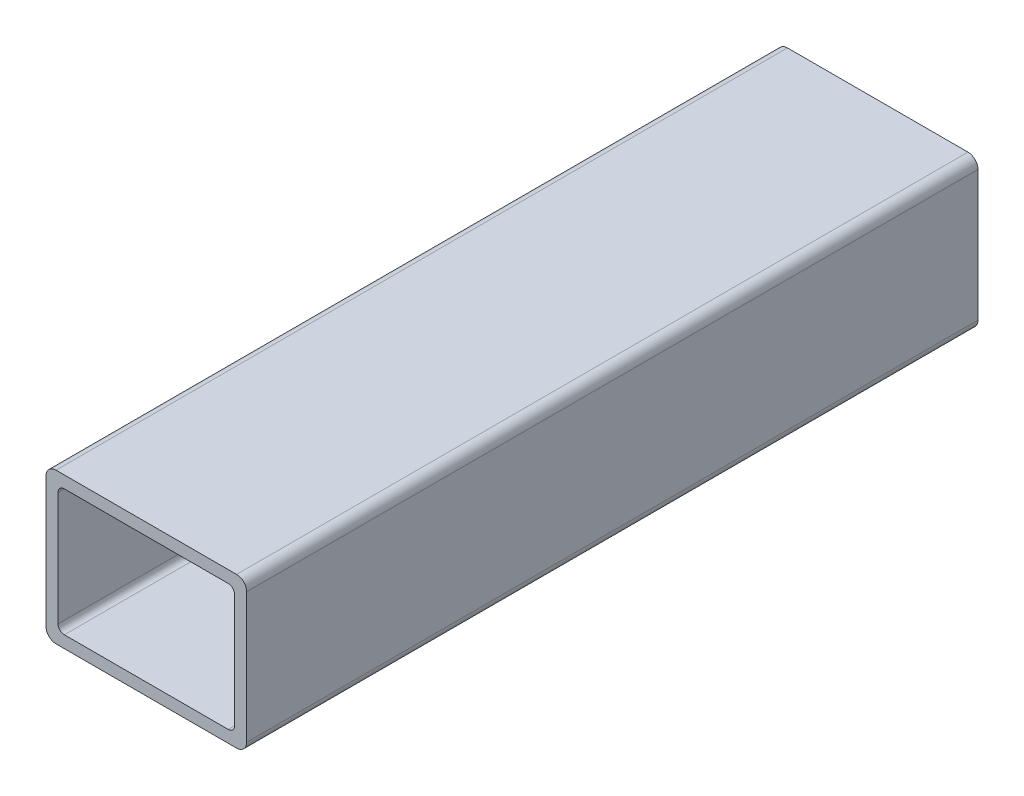
ISO-10303-21;
HEADER;
FILE_DESCRIPTION(('STEP AP214'),'2;1');
FILE_NAME('part.step','',(''),(''),'','','');
FILE_SCHEMA(('AUTOMOTIVE_DESIGN { 1 0 10303 214 1 1 1 1 }'));
ENDSEC;
DATA;
#1=APPLICATION_CONTEXT('core data for automotive mechanical design processes');
#2=APPLICATION_PROTOCOL_DEFINITION('international standard','automotive_design',2000,#1);
#3=PRODUCT_CONTEXT('',#1,'mechanical');
#4=PRODUCT('Part','Part','',(#3));
#5=PRODUCT_RELATED_PRODUCT_CATEGORY('part','',(#4));
#6=PRODUCT_DEFINITION_FORMATION('','',#4);
#7=PRODUCT_DEFINITION_CONTEXT('part definition',#1,'design');
#8=PRODUCT_DEFINITION('design','',#6,#7);
#9=PRODUCT_DEFINITION_SHAPE('','',#8);
#10=(LENGTH_UNIT() NAMED_UNIT(*) SI_UNIT(.MILLI.,.METRE.));
#11=(NAMED_UNIT(*) PLANE_ANGLE_UNIT() SI_UNIT($,.RADIAN.));
#12=(NAMED_UNIT(*) SI_UNIT($,.STERADIAN.) SOLID_ANGLE_UNIT());
#13=UNCERTAINTY_MEASURE_WITH_UNIT(LENGTH_MEASURE(1.E-05),#10,'distance_accuracy_value','');
#14=(GEOMETRIC_REPRESENTATION_CONTEXT(3) GLOBAL_UNCERTAINTY_ASSIGNED_CONTEXT((#13)) GLOBAL_UNIT_ASSIGNED_CONTEXT((#10,
#11,#12)) REPRESENTATION_CONTEXT('',''));
#15=CARTESIAN_POINT('',(0.,0.,0.));
#16=DIRECTION('',(0.,0.,1.));
#17=DIRECTION('',(1.,0.,0.));
#18=AXIS2_PLACEMENT_3D('',#15,#16,#17);
#19=CARTESIAN_POINT('',(22.86,-16.51,185.21934));
#20=DIRECTION('',(0.,0.,1.));
#21=DIRECTION('',(1.,0.,0.));
#22=AXIS2_PLACEMENT_3D('',#19,#20,#21);
#23=PLANE('',#22);
#24=CARTESIAN_POINT('',(22.86,-16.51,185.21934));
#25=DIRECTION('',(0.,0.,1.));
#26=DIRECTION('',(1.,0.,0.));
#27=AXIS2_PLACEMENT_3D('',#24,#25,#26);
#28=CIRCLE('',#27,2.53999999999999);
#29=CARTESIAN_POINT('',(22.86,-19.05,185.21934));
#30=VERTEX_POINT('',#29);
#31=CARTESIAN_POINT('',(25.4,-16.51,185.21934));
#32=VERTEX_POINT('',#31);
#33=EDGE_CURVE('E214',#30,#32,#28,.T.);
#34=ORIENTED_EDGE('',*,*,#33,.T.);
#35=DIRECTION('',(0.,1.,0.));
#36=VECTOR('',#35,1.);
#37=CARTESIAN_POINT('',(25.4,-16.51,185.21934));
#38=LINE('',#37,#36);
#39=CARTESIAN_POINT('',(25.4,16.51,185.21934));
#40=VERTEX_POINT('',#39);
#41=EDGE_CURVE('E217',#32,#40,#38,.T.);
#42=ORIENTED_EDGE('',*,*,#41,.T.);
#43=CARTESIAN_POINT('',(22.86,16.51,185.21934));
#44=DIRECTION('',(0.,0.,1.));
#45=DIRECTION('',(1.,0.,0.));
#46=AXIS2_PLACEMENT_3D('',#43,#44,#45);
#47=CIRCLE('',#46,2.54);
#48=CARTESIAN_POINT('',(22.86,19.05,185.21934));
#49=VERTEX_POINT('',#48);
#50=EDGE_CURVE('E220',#40,#49,#47,.T.);
#51=ORIENTED_EDGE('',*,*,#50,.T.);
#52=DIRECTION('',(-1.,0.,0.));
#53=VECTOR('',#52,1.);
#54=CARTESIAN_POINT('',(22.86,19.05,185.21934));
#55=LINE('',#54,#53);
#56=CARTESIAN_POINT('',(-22.86,19.05,185.21934));
#57=VERTEX_POINT('',#56);
#58=EDGE_CURVE('E222',#49,#57,#55,.T.);
#59=ORIENTED_EDGE('',*,*,#58,.T.);
#60=CARTESIAN_POINT('',(-22.86,16.51,185.21934));
#61=DIRECTION('',(0.,0.,1.));
#62=DIRECTION('',(1.,0.,0.));
#63=AXIS2_PLACEMENT_3D('',#60,#61,#62);
#64=CIRCLE('',#63,2.54);
#65=CARTESIAN_POINT('',(-25.4,16.51,185.21934));
#66=VERTEX_POINT('',#65);
#67=EDGE_CURVE('E224',#57,#66,#64,.T.);
#68=ORIENTED_EDGE('',*,*,#67,.T.);
#69=DIRECTION('',(0.,-1.,0.));
#70=VECTOR('',#69,1.);
#71=CARTESIAN_POINT('',(-25.4,-16.51,185.21934));
#72=LINE('',#71,#70);
#73=CARTESIAN_POINT('',(-25.4,-16.51,185.21934));
#74=VERTEX_POINT('',#73);
#75=EDGE_CURVE('E226',#66,#74,#72,.T.);
#76=ORIENTED_EDGE('',*,*,#75,.T.);
#77=CARTESIAN_POINT('',(-22.86,-16.51,185.21934));
#78=DIRECTION('',(0.,0.,1.));
#79=DIRECTION('',(1.,0.,0.));
#80=AXIS2_PLACEMENT_3D('',#77,#78,#79);
#81=CIRCLE('',#80,2.54);
#82=CARTESIAN_POINT('',(-22.86,-19.05,185.21934));
#83=VERTEX_POINT('',#82);
#84=EDGE_CURVE('E228',#74,#83,#81,.T.);
#85=ORIENTED_EDGE('',*,*,#84,.T.);
#86=DIRECTION('',(1.,0.,0.));
#87=VECTOR('',#86,1.);
#88=CARTESIAN_POINT('',(22.86,-19.05,185.21934));
#89=LINE('',#88,#87);
#90=EDGE_CURVE('E230',#83,#30,#89,.T.);
#91=ORIENTED_EDGE('',*,*,#90,.T.);
#92=EDGE_LOOP('',(#34,#42,#51,#59,#68,#76,#85,#91));
#93=FACE_BOUND('',#92,.T.);
#94=DIRECTION('',(-1.,0.,0.));
#95=VECTOR('',#94,1.);
#96=CARTESIAN_POINT('',(20.7518,16.002,185.21934));
#97=LINE('',#96,#95);
#98=CARTESIAN_POINT('',(20.7518,16.002,185.21934));
#99=VERTEX_POINT('',#98);
#100=CARTESIAN_POINT('',(-20.7518,16.002,185.21934));
#101=VERTEX_POINT('',#100);
#102=EDGE_CURVE('E157',#99,#101,#97,.T.);
#103=ORIENTED_EDGE('',*,*,#102,.F.);
#104=CARTESIAN_POINT('',(20.7518,14.4018,185.21934));
#105=DIRECTION('',(0.,0.,1.));
#106=DIRECTION('',(1.,0.,0.));
#107=AXIS2_PLACEMENT_3D('',#104,#105,#106);
#108=CIRCLE('',#107,1.6002);
#109=CARTESIAN_POINT('',(22.352,14.4018,185.21934));
#110=VERTEX_POINT('',#109);
#111=EDGE_CURVE('E149',#110,#99,#108,.T.);
#112=ORIENTED_EDGE('',*,*,#111,.F.);
#113=DIRECTION('',(0.,1.,0.));
#114=VECTOR('',#113,1.);
#115=CARTESIAN_POINT('',(22.352,14.4018,185.21934));
#116=LINE('',#115,#114);
#117=CARTESIAN_POINT('',(22.352,-14.4018,185.21934));
#118=VERTEX_POINT('',#117);
#119=EDGE_CURVE('E182',#118,#110,#116,.T.);
#120=ORIENTED_EDGE('',*,*,#119,.F.);
#121=CARTESIAN_POINT('',(20.7518,-14.4018,185.21934));
#122=DIRECTION('',(0.,0.,1.));
#123=DIRECTION('',(1.,0.,0.));
#124=AXIS2_PLACEMENT_3D('',#121,#122,#123);
#125=CIRCLE('',#124,1.6002);
#126=CARTESIAN_POINT('',(20.7518,-16.002,185.21934));
#127=VERTEX_POINT('',#126);
#128=EDGE_CURVE('E180',#127,#118,#125,.T.);
#129=ORIENTED_EDGE('',*,*,#128,.F.);
#130=DIRECTION('',(1.,0.,0.));
#131=VECTOR('',#130,1.);
#132=CARTESIAN_POINT('',(20.7518,-16.002,185.21934));
#133=LINE('',#132,#131);
#134=CARTESIAN_POINT('',(-20.7518,-16.002,185.21934));
#135=VERTEX_POINT('',#134);
#136=EDGE_CURVE('E178',#135,#127,#133,.T.);
#137=ORIENTED_EDGE('',*,*,#136,.F.);
#138=CARTESIAN_POINT('',(-20.7518,-14.4018,185.21934));
#139=DIRECTION('',(0.,0.,1.));
#140=DIRECTION('',(1.,0.,0.));
#141=AXIS2_PLACEMENT_3D('',#138,#139,#140);
#142=CIRCLE('',#141,1.6002);
#143=CARTESIAN_POINT('',(-22.352,-14.4018,185.21934));
#144=VERTEX_POINT('',#143);
#145=EDGE_CURVE('E176',#144,#135,#142,.T.);
#146=ORIENTED_EDGE('',*,*,#145,.F.);
#147=DIRECTION('',(0.,-1.,0.));
#148=VECTOR('',#147,1.);
#149=CARTESIAN_POINT('',(-22.352,14.4018,185.21934));
#150=LINE('',#149,#148);
#151=CARTESIAN_POINT('',(-22.352,14.4018,185.21934));
#152=VERTEX_POINT('',#151);
#153=EDGE_CURVE('E172',#152,#144,#150,.T.);
#154=ORIENTED_EDGE('',*,*,#153,.F.);
#155=CARTESIAN_POINT('',(-20.7518,14.4018,185.21934));
#156=DIRECTION('',(0.,0.,1.));
#157=DIRECTION('',(1.,0.,0.));
#158=AXIS2_PLACEMENT_3D('',#155,#156,#157);
#159=CIRCLE('',#158,1.6002);
#160=EDGE_CURVE('E170',#101,#152,#159,.T.);
#161=ORIENTED_EDGE('',*,*,#160,.F.);
#162=EDGE_LOOP('',(#103,#112,#120,#129,#137,#146,#154,#161));
#163=FACE_BOUND('',#162,.T.);
#164=ADVANCED_FACE('F36',(#93,#163),#23,.T.);
#165=CARTESIAN_POINT('',(22.86,-16.51,0.));
#166=DIRECTION('',(0.,0.,1.));
#167=DIRECTION('',(1.,0.,0.));
#168=AXIS2_PLACEMENT_3D('',#165,#166,#167);
#169=PLANE('',#168);
#170=CARTESIAN_POINT('',(22.86,-16.51,0.));
#171=DIRECTION('',(0.,0.,1.));
#172=DIRECTION('',(1.,0.,0.));
#173=AXIS2_PLACEMENT_3D('',#170,#171,#172);
#174=CIRCLE('',#173,2.53999999999999);
#175=CARTESIAN_POINT('',(22.86,-19.05,0.));
#176=VERTEX_POINT('',#175);
#177=CARTESIAN_POINT('',(25.4,-16.51,0.));
#178=VERTEX_POINT('',#177);
#179=EDGE_CURVE('E165',#176,#178,#174,.T.);
#180=ORIENTED_EDGE('',*,*,#179,.F.);
#181=DIRECTION('',(1.,0.,0.));
#182=VECTOR('',#181,1.);
#183=CARTESIAN_POINT('',(22.86,-19.05,0.));
#184=LINE('',#183,#182);
#185=CARTESIAN_POINT('',(-22.86,-19.05,0.));
#186=VERTEX_POINT('',#185);
#187=EDGE_CURVE('E218',#186,#176,#184,.T.);
#188=ORIENTED_EDGE('',*,*,#187,.F.);
#189=CARTESIAN_POINT('',(-22.86,-16.51,0.));
#190=DIRECTION('',(0.,0.,1.));
#191=DIRECTION('',(1.,0.,0.));
#192=AXIS2_PLACEMENT_3D('',#189,#190,#191);
#193=CIRCLE('',#192,2.54);
#194=CARTESIAN_POINT('',(-25.4,-16.51,0.));
#195=VERTEX_POINT('',#194);
#196=EDGE_CURVE('E245',#195,#186,#193,.T.);
#197=ORIENTED_EDGE('',*,*,#196,.F.);
#198=DIRECTION('',(0.,-1.,0.));
#199=VECTOR('',#198,1.);
#200=CARTESIAN_POINT('',(-25.4,-16.51,0.));
#201=LINE('',#200,#199);
#202=CARTESIAN_POINT('',(-25.4,16.51,0.));
#203=VERTEX_POINT('',#202);
#204=EDGE_CURVE('E243',#203,#195,#201,.T.);
#205=ORIENTED_EDGE('',*,*,#204,.F.);
#206=CARTESIAN_POINT('',(-22.86,16.51,0.));
#207=DIRECTION('',(0.,0.,1.));
#208=DIRECTION('',(1.,0.,0.));
#209=AXIS2_PLACEMENT_3D('',#206,#207,#208);
#210=CIRCLE('',#209,2.54);
#211=CARTESIAN_POINT('',(-22.86,19.05,0.));
#212=VERTEX_POINT('',#211);
#213=EDGE_CURVE('E241',#212,#203,#210,.T.);
#214=ORIENTED_EDGE('',*,*,#213,.F.);
#215=DIRECTION('',(-1.,0.,0.));
#216=VECTOR('',#215,1.);
#217=CARTESIAN_POINT('',(22.86,19.05,0.));
#218=LINE('',#217,#216);
#219=CARTESIAN_POINT('',(22.86,19.05,0.));
#220=VERTEX_POINT('',#219);
#221=EDGE_CURVE('E239',#220,#212,#218,.T.);
#222=ORIENTED_EDGE('',*,*,#221,.F.);
#223=CARTESIAN_POINT('',(22.86,16.51,0.));
#224=DIRECTION('',(0.,0.,1.));
#225=DIRECTION('',(1.,0.,0.));
#226=AXIS2_PLACEMENT_3D('',#223,#224,#225);
#227=CIRCLE('',#226,2.54);
#228=CARTESIAN_POINT('',(25.4,16.51,0.));
#229=VERTEX_POINT('',#228);
#230=EDGE_CURVE('E237',#229,#220,#227,.T.);
#231=ORIENTED_EDGE('',*,*,#230,.F.);
#232=DIRECTION('',(0.,1.,0.));
#233=VECTOR('',#232,1.);
#234=CARTESIAN_POINT('',(25.4,-16.51,0.));
#235=LINE('',#234,#233);
#236=EDGE_CURVE('E235',#178,#229,#235,.T.);
#237=ORIENTED_EDGE('',*,*,#236,.F.);
#238=EDGE_LOOP('',(#180,#188,#197,#205,#214,#222,#231,#237));
#239=FACE_BOUND('',#238,.T.);
#240=CARTESIAN_POINT('',(20.7518,14.4018,0.));
#241=DIRECTION('',(0.,0.,1.));
#242=DIRECTION('',(1.,0.,0.));
#243=AXIS2_PLACEMENT_3D('',#240,#241,#242);
#244=CIRCLE('',#243,1.6002);
#245=CARTESIAN_POINT('',(22.352,14.4018,0.));
#246=VERTEX_POINT('',#245);
#247=CARTESIAN_POINT('',(20.7518,16.002,0.));
#248=VERTEX_POINT('',#247);
#249=EDGE_CURVE('E59',#246,#248,#244,.T.);
#250=ORIENTED_EDGE('',*,*,#249,.T.);
#251=DIRECTION('',(-1.,0.,0.));
#252=VECTOR('',#251,1.);
#253=CARTESIAN_POINT('',(20.7518,16.002,0.));
#254=LINE('',#253,#252);
#255=CARTESIAN_POINT('',(-20.7518,16.002,0.));
#256=VERTEX_POINT('',#255);
#257=EDGE_CURVE('E164',#248,#256,#254,.T.);
#258=ORIENTED_EDGE('',*,*,#257,.T.);
#259=CARTESIAN_POINT('',(-20.7518,14.4018,0.));
#260=DIRECTION('',(0.,0.,1.));
#261=DIRECTION('',(1.,0.,0.));
#262=AXIS2_PLACEMENT_3D('',#259,#260,#261);
#263=CIRCLE('',#262,1.6002);
#264=CARTESIAN_POINT('',(-22.352,14.4018,0.));
#265=VERTEX_POINT('',#264);
#266=EDGE_CURVE('E186',#256,#265,#263,.T.);
#267=ORIENTED_EDGE('',*,*,#266,.T.);
#268=DIRECTION('',(0.,-1.,0.));
#269=VECTOR('',#268,1.);
#270=CARTESIAN_POINT('',(-22.352,14.4018,0.));
#271=LINE('',#270,#269);
#272=CARTESIAN_POINT('',(-22.352,-14.4018,0.));
#273=VERTEX_POINT('',#272);
#274=EDGE_CURVE('E189',#265,#273,#271,.T.);
#275=ORIENTED_EDGE('',*,*,#274,.T.);
#276=CARTESIAN_POINT('',(-20.7518,-14.4018,0.));
#277=DIRECTION('',(0.,0.,1.));
#278=DIRECTION('',(1.,0.,0.));
#279=AXIS2_PLACEMENT_3D('',#276,#277,#278);
#280=CIRCLE('',#279,1.6002);
#281=CARTESIAN_POINT('',(-20.7518,-16.002,0.));
#282=VERTEX_POINT('',#281);
#283=EDGE_CURVE('E192',#273,#282,#280,.T.);
#284=ORIENTED_EDGE('',*,*,#283,.T.);
#285=DIRECTION('',(1.,0.,0.));
#286=VECTOR('',#285,1.);
#287=CARTESIAN_POINT('',(20.7518,-16.002,0.));
#288=LINE('',#287,#286);
#289=CARTESIAN_POINT('',(20.7518,-16.002,0.));
#290=VERTEX_POINT('',#289);
#291=EDGE_CURVE('E195',#282,#290,#288,.T.);
#292=ORIENTED_EDGE('',*,*,#291,.T.);
#293=CARTESIAN_POINT('',(20.7518,-14.4018,0.));
#294=DIRECTION('',(0.,0.,1.));
#295=DIRECTION('',(1.,0.,0.));
#296=AXIS2_PLACEMENT_3D('',#293,#294,#295);
#297=CIRCLE('',#296,1.6002);
#298=CARTESIAN_POINT('',(22.352,-14.4018,0.));
#299=VERTEX_POINT('',#298);
#300=EDGE_CURVE('E198',#290,#299,#297,.T.);
#301=ORIENTED_EDGE('',*,*,#300,.T.);
#302=DIRECTION('',(0.,1.,0.));
#303=VECTOR('',#302,1.);
#304=CARTESIAN_POINT('',(22.352,14.4018,0.));
#305=LINE('',#304,#303);
#306=EDGE_CURVE('E158',#299,#246,#305,.T.);
#307=ORIENTED_EDGE('',*,*,#306,.T.);
#308=EDGE_LOOP('',(#250,#258,#267,#275,#284,#292,#301,#307));
#309=FACE_BOUND('',#308,.T.);
#310=ADVANCED_FACE('F275',(#239,#309),#169,.F.);
#311=CARTESIAN_POINT('',(22.86,-16.51,185.21934));
#312=DIRECTION('',(0.,0.,-1.));
#313=DIRECTION('',(-1.,0.,0.));
#314=AXIS2_PLACEMENT_3D('',#311,#312,#313);
#315=CYLINDRICAL_SURFACE('',#314,2.53999999999999);
#316=ORIENTED_EDGE('',*,*,#179,.T.);
#317=DIRECTION('',(0.,0.,-1.));
#318=VECTOR('',#317,1.);
#319=CARTESIAN_POINT('',(25.4,-16.51,185.21934));
#320=LINE('',#319,#318);
#321=EDGE_CURVE('E11',#32,#178,#320,.T.);
#322=ORIENTED_EDGE('',*,*,#321,.F.);
#323=ORIENTED_EDGE('',*,*,#33,.F.);
#324=DIRECTION('',(0.,0.,-1.));
#325=VECTOR('',#324,1.);
#326=CARTESIAN_POINT('',(22.86,-19.05,185.21934));
#327=LINE('',#326,#325);
#328=EDGE_CURVE('E232',#30,#176,#327,.T.);
#329=ORIENTED_EDGE('',*,*,#328,.T.);
#330=EDGE_LOOP('',(#316,#322,#323,#329));
#331=FACE_BOUND('',#330,.T.);
#332=ADVANCED_FACE('F38',(#331),#315,.T.);
#333=CARTESIAN_POINT('',(25.4,-16.51,185.21934));
#334=DIRECTION('',(-1.,0.,0.));
#335=DIRECTION('',(0.,0.,1.));
#336=AXIS2_PLACEMENT_3D('',#333,#334,#335);
#337=PLANE('',#336);
#338=ORIENTED_EDGE('',*,*,#236,.T.);
#339=DIRECTION('',(0.,0.,-1.));
#340=VECTOR('',#339,1.);
#341=CARTESIAN_POINT('',(25.4,16.51,185.21934));
#342=LINE('',#341,#340);
#343=EDGE_CURVE('E44',#40,#229,#342,.T.);
#344=ORIENTED_EDGE('',*,*,#343,.F.);
#345=ORIENTED_EDGE('',*,*,#41,.F.);
#346=ORIENTED_EDGE('',*,*,#321,.T.);
#347=EDGE_LOOP('',(#338,#344,#345,#346));
#348=FACE_BOUND('',#347,.T.);
#349=ADVANCED_FACE('F292',(#348),#337,.F.);
#350=CARTESIAN_POINT('',(22.86,16.51,185.21934));
#351=DIRECTION('',(0.,0.,-1.));
#352=DIRECTION('',(-1.,0.,0.));
#353=AXIS2_PLACEMENT_3D('',#350,#351,#352);
#354=CYLINDRICAL_SURFACE('',#353,2.54);
#355=ORIENTED_EDGE('',*,*,#230,.T.);
#356=DIRECTION('',(0.,0.,-1.));
#357=VECTOR('',#356,1.);
#358=CARTESIAN_POINT('',(22.86,19.05,185.21934));
#359=LINE('',#358,#357);
#360=EDGE_CURVE('E262',#49,#220,#359,.T.);
#361=ORIENTED_EDGE('',*,*,#360,.F.);
#362=ORIENTED_EDGE('',*,*,#50,.F.);
#363=ORIENTED_EDGE('',*,*,#343,.T.);
#364=EDGE_LOOP('',(#355,#361,#362,#363));
#365=FACE_BOUND('',#364,.T.);
#366=ADVANCED_FACE('F269',(#365),#354,.T.);
#367=CARTESIAN_POINT('',(22.86,19.05,185.21934));
#368=DIRECTION('',(0.,-1.,0.));
#369=DIRECTION('',(0.,0.,-1.));
#370=AXIS2_PLACEMENT_3D('',#367,#368,#369);
#371=PLANE('',#370);
#372=ORIENTED_EDGE('',*,*,#221,.T.);
#373=DIRECTION('',(0.,0.,-1.));
#374=VECTOR('',#373,1.);
#375=CARTESIAN_POINT('',(-22.86,19.05,185.21934));
#376=LINE('',#375,#374);
#377=EDGE_CURVE('E259',#57,#212,#376,.T.);
#378=ORIENTED_EDGE('',*,*,#377,.F.);
#379=ORIENTED_EDGE('',*,*,#58,.F.);
#380=ORIENTED_EDGE('',*,*,#360,.T.);
#381=EDGE_LOOP('',(#372,#378,#379,#380));
#382=FACE_BOUND('',#381,.T.);
#383=ADVANCED_FACE('F281',(#382),#371,.F.);
#384=CARTESIAN_POINT('',(-22.86,16.51,185.21934));
#385=DIRECTION('',(0.,0.,-1.));
#386=DIRECTION('',(-1.,0.,0.));
#387=AXIS2_PLACEMENT_3D('',#384,#385,#386);
#388=CYLINDRICAL_SURFACE('',#387,2.54);
#389=ORIENTED_EDGE('',*,*,#213,.T.);
#390=DIRECTION('',(0.,0.,-1.));
#391=VECTOR('',#390,1.);
#392=CARTESIAN_POINT('',(-25.4,16.51,185.21934));
#393=LINE('',#392,#391);
#394=EDGE_CURVE('E256',#66,#203,#393,.T.);
#395=ORIENTED_EDGE('',*,*,#394,.F.);
#396=ORIENTED_EDGE('',*,*,#67,.F.);
#397=ORIENTED_EDGE('',*,*,#377,.T.);
#398=EDGE_LOOP('',(#389,#395,#396,#397));
#399=FACE_BOUND('',#398,.T.);
#400=ADVANCED_FACE('F285',(#399),#388,.T.);
#401=CARTESIAN_POINT('',(-25.4,-16.51,185.21934));
#402=DIRECTION('',(1.,0.,0.));
#403=DIRECTION('',(0.,1.,0.));
#404=AXIS2_PLACEMENT_3D('',#401,#402,#403);
#405=PLANE('',#404);
#406=ORIENTED_EDGE('',*,*,#204,.T.);
#407=DIRECTION('',(0.,0.,-1.));
#408=VECTOR('',#407,1.);
#409=CARTESIAN_POINT('',(-25.4,-16.51,185.21934));
#410=LINE('',#409,#408);
#411=EDGE_CURVE('E253',#74,#195,#410,.T.);
#412=ORIENTED_EDGE('',*,*,#411,.F.);
#413=ORIENTED_EDGE('',*,*,#75,.F.);
#414=ORIENTED_EDGE('',*,*,#394,.T.);
#415=EDGE_LOOP('',(#406,#412,#413,#414));
#416=FACE_BOUND('',#415,.T.);
#417=ADVANCED_FACE('F305',(#416),#405,.F.);
#418=CARTESIAN_POINT('',(-22.86,-16.51,185.21934));
#419=DIRECTION('',(0.,0.,-1.));
#420=DIRECTION('',(-1.,0.,0.));
#421=AXIS2_PLACEMENT_3D('',#418,#419,#420);
#422=CYLINDRICAL_SURFACE('',#421,2.54);
#423=ORIENTED_EDGE('',*,*,#196,.T.);
#424=DIRECTION('',(0.,0.,-1.));
#425=VECTOR('',#424,1.);
#426=CARTESIAN_POINT('',(-22.86,-19.05,185.21934));
#427=LINE('',#426,#425);
#428=EDGE_CURVE('E250',#83,#186,#427,.T.);
#429=ORIENTED_EDGE('',*,*,#428,.F.);
#430=ORIENTED_EDGE('',*,*,#84,.F.);
#431=ORIENTED_EDGE('',*,*,#411,.T.);
#432=EDGE_LOOP('',(#423,#429,#430,#431));
#433=FACE_BOUND('',#432,.T.);
#434=ADVANCED_FACE('F303',(#433),#422,.T.);
#435=CARTESIAN_POINT('',(22.86,-19.05,185.21934));
#436=DIRECTION('',(0.,1.,0.));
#437=DIRECTION('',(-1.,0.,0.));
#438=AXIS2_PLACEMENT_3D('',#435,#436,#437);
#439=PLANE('',#438);
#440=ORIENTED_EDGE('',*,*,#187,.T.);
#441=ORIENTED_EDGE('',*,*,#328,.F.);
#442=ORIENTED_EDGE('',*,*,#90,.F.);
#443=ORIENTED_EDGE('',*,*,#428,.T.);
#444=EDGE_LOOP('',(#440,#441,#442,#443));
#445=FACE_BOUND('',#444,.T.);
#446=ADVANCED_FACE('F298',(#445),#439,.F.);
#447=CARTESIAN_POINT('',(20.7518,14.4018,185.21934));
#448=DIRECTION('',(0.,0.,-1.));
#449=DIRECTION('',(-1.,0.,0.));
#450=AXIS2_PLACEMENT_3D('',#447,#448,#449);
#451=CYLINDRICAL_SURFACE('',#450,1.6002);
#452=ORIENTED_EDGE('',*,*,#249,.F.);
#453=DIRECTION('',(0.,0.,-1.));
#454=VECTOR('',#453,1.);
#455=CARTESIAN_POINT('',(22.352,14.4018,185.21934));
#456=LINE('',#455,#454);
#457=EDGE_CURVE('E153',#110,#246,#456,.T.);
#458=ORIENTED_EDGE('',*,*,#457,.F.);
#459=ORIENTED_EDGE('',*,*,#111,.T.);
#460=DIRECTION('',(0.,0.,-1.));
#461=VECTOR('',#460,1.);
#462=CARTESIAN_POINT('',(20.7518,16.002,185.21934));
#463=LINE('',#462,#461);
#464=EDGE_CURVE('E152',#99,#248,#463,.T.);
#465=ORIENTED_EDGE('',*,*,#464,.T.);
#466=EDGE_LOOP('',(#452,#458,#459,#465));
#467=FACE_BOUND('',#466,.T.);
#468=ADVANCED_FACE('F151',(#467),#451,.F.);
#469=CARTESIAN_POINT('',(20.7518,16.002,185.21934));
#470=DIRECTION('',(0.,-1.,0.));
#471=DIRECTION('',(1.,0.,0.));
#472=AXIS2_PLACEMENT_3D('',#469,#470,#471);
#473=PLANE('',#472);
#474=ORIENTED_EDGE('',*,*,#257,.F.);
#475=ORIENTED_EDGE('',*,*,#464,.F.);
#476=ORIENTED_EDGE('',*,*,#102,.T.);
#477=DIRECTION('',(0.,0.,-1.));
#478=VECTOR('',#477,1.);
#479=CARTESIAN_POINT('',(-20.7518,16.002,185.21934));
#480=LINE('',#479,#478);
#481=EDGE_CURVE('E166',#101,#256,#480,.T.);
#482=ORIENTED_EDGE('',*,*,#481,.T.);
#483=EDGE_LOOP('',(#474,#475,#476,#482));
#484=FACE_BOUND('',#483,.T.);
#485=ADVANCED_FACE('F161',(#484),#473,.T.);
#486=CARTESIAN_POINT('',(-20.7518,14.4018,185.21934));
#487=DIRECTION('',(0.,0.,-1.));
#488=DIRECTION('',(-1.,0.,0.));
#489=AXIS2_PLACEMENT_3D('',#486,#487,#488);
#490=CYLINDRICAL_SURFACE('',#489,1.6002);
#491=ORIENTED_EDGE('',*,*,#266,.F.);
#492=ORIENTED_EDGE('',*,*,#481,.F.);
#493=ORIENTED_EDGE('',*,*,#160,.T.);
#494=DIRECTION('',(0.,0.,-1.));
#495=VECTOR('',#494,1.);
#496=CARTESIAN_POINT('',(-22.352,14.4018,185.21934));
#497=LINE('',#496,#495);
#498=EDGE_CURVE('E211',#152,#265,#497,.T.);
#499=ORIENTED_EDGE('',*,*,#498,.T.);
#500=EDGE_LOOP('',(#491,#492,#493,#499));
#501=FACE_BOUND('',#500,.T.);
#502=ADVANCED_FACE('F330',(#501),#490,.F.);
#503=CARTESIAN_POINT('',(-22.352,14.4018,185.21934));
#504=DIRECTION('',(1.,0.,0.));
#505=DIRECTION('',(0.,1.,0.));
#506=AXIS2_PLACEMENT_3D('',#503,#504,#505);
#507=PLANE('',#506);
#508=ORIENTED_EDGE('',*,*,#274,.F.);
#509=ORIENTED_EDGE('',*,*,#498,.F.);
#510=ORIENTED_EDGE('',*,*,#153,.T.);
#511=DIRECTION('',(0.,0.,-1.));
#512=VECTOR('',#511,1.);
#513=CARTESIAN_POINT('',(-22.352,-14.4018,185.21934));
#514=LINE('',#513,#512);
#515=EDGE_CURVE('E209',#144,#273,#514,.T.);
#516=ORIENTED_EDGE('',*,*,#515,.T.);
#517=EDGE_LOOP('',(#508,#509,#510,#516));
#518=FACE_BOUND('',#517,.T.);
#519=ADVANCED_FACE('F334',(#518),#507,.T.);
#520=CARTESIAN_POINT('',(-20.7518,-14.4018,185.21934));
#521=DIRECTION('',(0.,0.,-1.));
#522=DIRECTION('',(-1.,0.,0.));
#523=AXIS2_PLACEMENT_3D('',#520,#521,#522);
#524=CYLINDRICAL_SURFACE('',#523,1.6002);
#525=ORIENTED_EDGE('',*,*,#283,.F.);
#526=ORIENTED_EDGE('',*,*,#515,.F.);
#527=ORIENTED_EDGE('',*,*,#145,.T.);
#528=DIRECTION('',(0.,0.,-1.));
#529=VECTOR('',#528,1.);
#530=CARTESIAN_POINT('',(-20.7518,-16.002,185.21934));
#531=LINE('',#530,#529);
#532=EDGE_CURVE('E207',#135,#282,#531,.T.);
#533=ORIENTED_EDGE('',*,*,#532,.T.);
#534=EDGE_LOOP('',(#525,#526,#527,#533));
#535=FACE_BOUND('',#534,.T.);
#536=ADVANCED_FACE('F340',(#535),#524,.F.);
#537=CARTESIAN_POINT('',(20.7518,-16.002,185.21934));
#538=DIRECTION('',(0.,1.,0.));
#539=DIRECTION('',(-1.,0.,0.));
#540=AXIS2_PLACEMENT_3D('',#537,#538,#539);
#541=PLANE('',#540);
#542=ORIENTED_EDGE('',*,*,#291,.F.);
#543=ORIENTED_EDGE('',*,*,#532,.F.);
#544=ORIENTED_EDGE('',*,*,#136,.T.);
#545=DIRECTION('',(0.,0.,-1.));
#546=VECTOR('',#545,1.);
#547=CARTESIAN_POINT('',(20.7518,-16.002,185.21934));
#548=LINE('',#547,#546);
#549=EDGE_CURVE('E205',#127,#290,#548,.T.);
#550=ORIENTED_EDGE('',*,*,#549,.T.);
#551=EDGE_LOOP('',(#542,#543,#544,#550));
#552=FACE_BOUND('',#551,.T.);
#553=ADVANCED_FACE('F344',(#552),#541,.T.);
#554=CARTESIAN_POINT('',(20.7518,-14.4018,185.21934));
#555=DIRECTION('',(0.,0.,-1.));
#556=DIRECTION('',(-1.,0.,0.));
#557=AXIS2_PLACEMENT_3D('',#554,#555,#556);
#558=CYLINDRICAL_SURFACE('',#557,1.6002);
#559=ORIENTED_EDGE('',*,*,#300,.F.);
#560=ORIENTED_EDGE('',*,*,#549,.F.);
#561=ORIENTED_EDGE('',*,*,#128,.T.);
#562=DIRECTION('',(0.,0.,-1.));
#563=VECTOR('',#562,1.);
#564=CARTESIAN_POINT('',(22.352,-14.4018,185.21934));
#565=LINE('',#564,#563);
#566=EDGE_CURVE('E51',#118,#299,#565,.T.);
#567=ORIENTED_EDGE('',*,*,#566,.T.);
#568=EDGE_LOOP('',(#559,#560,#561,#567));
#569=FACE_BOUND('',#568,.T.);
#570=ADVANCED_FACE('F348',(#569),#558,.F.);
#571=CARTESIAN_POINT('',(22.352,14.4018,185.21934));
#572=DIRECTION('',(-1.,0.,0.));
#573=DIRECTION('',(0.,-1.,0.));
#574=AXIS2_PLACEMENT_3D('',#571,#572,#573);
#575=PLANE('',#574);
#576=ORIENTED_EDGE('',*,*,#306,.F.);
#577=ORIENTED_EDGE('',*,*,#566,.F.);
#578=ORIENTED_EDGE('',*,*,#119,.T.);
#579=ORIENTED_EDGE('',*,*,#457,.T.);
#580=EDGE_LOOP('',(#576,#577,#578,#579));
#581=FACE_BOUND('',#580,.T.);
#582=ADVANCED_FACE('F352',(#581),#575,.T.);
#583=CLOSED_SHELL('',(#164,#310,#332,#349,#366,#383,#400,#417,#434,#446,#468,#485,#502,#519,
#536,#553,#570,#582));
#584=MANIFOLD_SOLID_BREP('B2',#583);
#585=ADVANCED_BREP_SHAPE_REPRESENTATION('',(#18,#584),#14);
#586=SHAPE_DEFINITION_REPRESENTATION(#9,#585);
ENDSEC;
END-ISO-10303-21;
